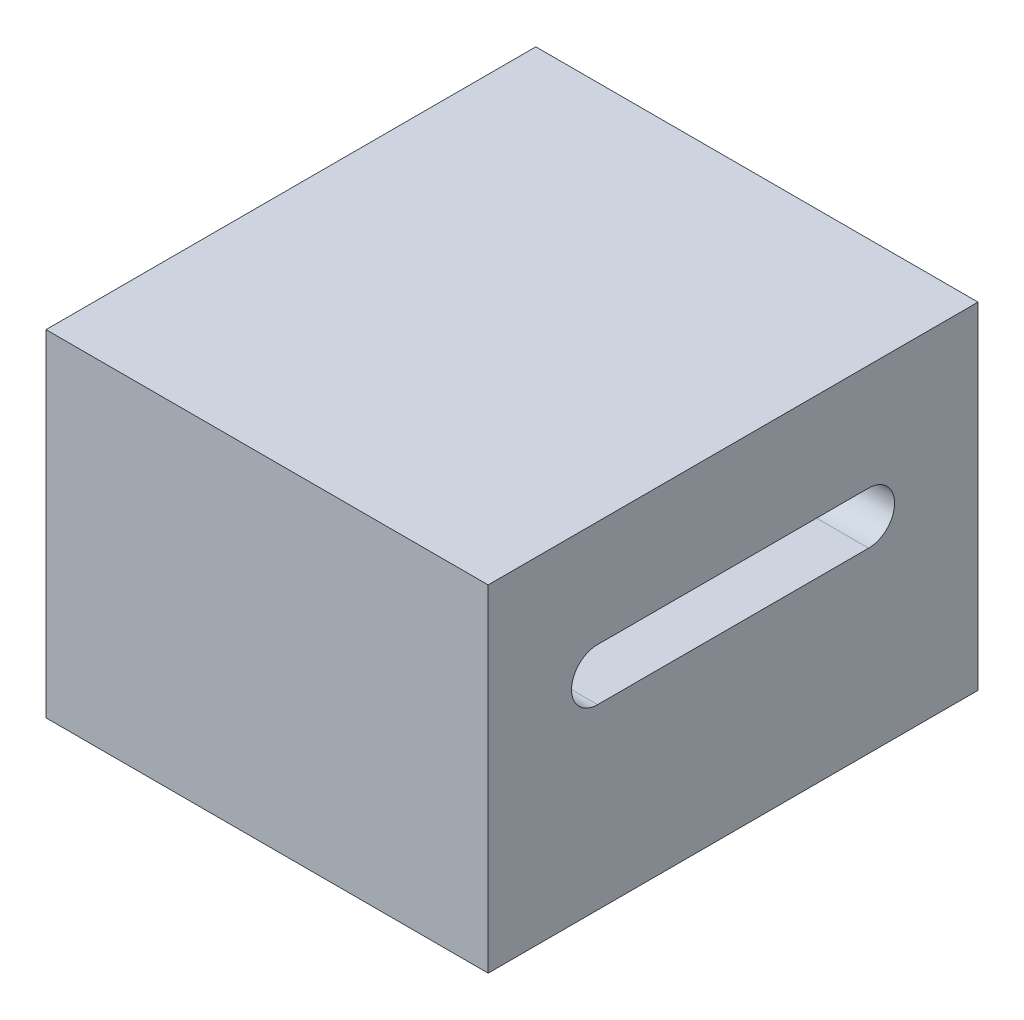
ISO-10303-21;
HEADER;
FILE_DESCRIPTION(('STEP AP214'),'2;1');
FILE_NAME('part.step','',(''),(''),'','','');
FILE_SCHEMA(('AUTOMOTIVE_DESIGN { 1 0 10303 214 1 1 1 1 }'));
ENDSEC;
DATA;
#1=APPLICATION_CONTEXT('core data for automotive mechanical design processes');
#2=APPLICATION_PROTOCOL_DEFINITION('international standard','automotive_design',2000,#1);
#3=PRODUCT_CONTEXT('',#1,'mechanical');
#4=PRODUCT('Part','Part','',(#3));
#5=PRODUCT_RELATED_PRODUCT_CATEGORY('part','',(#4));
#6=PRODUCT_DEFINITION_FORMATION('','',#4);
#7=PRODUCT_DEFINITION_CONTEXT('part definition',#1,'design');
#8=PRODUCT_DEFINITION('design','',#6,#7);
#9=PRODUCT_DEFINITION_SHAPE('','',#8);
#10=(LENGTH_UNIT() NAMED_UNIT(*) SI_UNIT(.MILLI.,.METRE.));
#11=(NAMED_UNIT(*) PLANE_ANGLE_UNIT() SI_UNIT($,.RADIAN.));
#12=(NAMED_UNIT(*) SI_UNIT($,.STERADIAN.) SOLID_ANGLE_UNIT());
#13=UNCERTAINTY_MEASURE_WITH_UNIT(LENGTH_MEASURE(1.E-05),#10,'distance_accuracy_value','');
#14=(GEOMETRIC_REPRESENTATION_CONTEXT(3) GLOBAL_UNCERTAINTY_ASSIGNED_CONTEXT((#13)) GLOBAL_UNIT_ASSIGNED_CONTEXT((#10,
#11,#12)) REPRESENTATION_CONTEXT('',''));
#15=CARTESIAN_POINT('',(0.,0.,0.));
#16=DIRECTION('',(0.,0.,1.));
#17=DIRECTION('',(1.,0.,0.));
#18=AXIS2_PLACEMENT_3D('',#15,#16,#17);
#19=CARTESIAN_POINT('',(0.,32.258,0.));
#20=DIRECTION('',(1.,0.,0.));
#21=DIRECTION('',(0.,0.,-1.));
#22=AXIS2_PLACEMENT_3D('',#19,#20,#21);
#23=PLANE('',#22);
#24=DIRECTION('',(0.,0.,1.));
#25=VECTOR('',#24,1.);
#26=CARTESIAN_POINT('',(0.,22.0541129997099,-10.495));
#27=LINE('',#26,#25);
#28=CARTESIAN_POINT('',(0.,22.0541129997099,-36.495));
#29=VERTEX_POINT('',#28);
#30=CARTESIAN_POINT('',(0.,22.0541129997099,-10.495));
#31=VERTEX_POINT('',#30);
#32=EDGE_CURVE('E112',#29,#31,#27,.T.);
#33=ORIENTED_EDGE('',*,*,#32,.T.);
#34=CARTESIAN_POINT('',(0.,19.558,-10.495));
#35=DIRECTION('',(1.,0.,0.));
#36=DIRECTION('',(0.,0.,-1.));
#37=AXIS2_PLACEMENT_3D('',#34,#35,#36);
#38=CIRCLE('',#37,2.49611299970985);
#39=CARTESIAN_POINT('',(0.,17.0618870002902,-10.495));
#40=VERTEX_POINT('',#39);
#41=EDGE_CURVE('E105',#31,#40,#38,.T.);
#42=ORIENTED_EDGE('',*,*,#41,.T.);
#43=DIRECTION('',(0.,0.,-1.));
#44=VECTOR('',#43,1.);
#45=CARTESIAN_POINT('',(0.,17.0618870002902,-10.495));
#46=LINE('',#45,#44);
#47=CARTESIAN_POINT('',(0.,17.0618870002902,-36.495));
#48=VERTEX_POINT('',#47);
#49=EDGE_CURVE('E115',#40,#48,#46,.T.);
#50=ORIENTED_EDGE('',*,*,#49,.T.);
#51=CARTESIAN_POINT('',(0.,19.558,-36.495));
#52=DIRECTION('',(1.,0.,0.));
#53=DIRECTION('',(0.,0.,-1.));
#54=AXIS2_PLACEMENT_3D('',#51,#52,#53);
#55=CIRCLE('',#54,2.49611299970985);
#56=EDGE_CURVE('E53',#48,#29,#55,.T.);
#57=ORIENTED_EDGE('',*,*,#56,.T.);
#58=EDGE_LOOP('',(#33,#42,#50,#57));
#59=FACE_BOUND('',#58,.T.);
#60=DIRECTION('',(0.,0.,1.));
#61=VECTOR('',#60,1.);
#62=CARTESIAN_POINT('',(0.,0.,0.));
#63=LINE('',#62,#61);
#64=CARTESIAN_POINT('',(0.,0.,-46.99));
#65=VERTEX_POINT('',#64);
#66=CARTESIAN_POINT('',(0.,0.,0.));
#67=VERTEX_POINT('',#66);
#68=EDGE_CURVE('E145',#65,#67,#63,.T.);
#69=ORIENTED_EDGE('',*,*,#68,.T.);
#70=DIRECTION('',(0.,-1.,0.));
#71=VECTOR('',#70,1.);
#72=CARTESIAN_POINT('',(0.,32.258,0.));
#73=LINE('',#72,#71);
#74=CARTESIAN_POINT('',(0.,32.258,0.));
#75=VERTEX_POINT('',#74);
#76=EDGE_CURVE('E11',#75,#67,#73,.T.);
#77=ORIENTED_EDGE('',*,*,#76,.F.);
#78=DIRECTION('',(0.,0.,1.));
#79=VECTOR('',#78,1.);
#80=CARTESIAN_POINT('',(0.,32.258,0.));
#81=LINE('',#80,#79);
#82=CARTESIAN_POINT('',(0.,32.258,-46.99));
#83=VERTEX_POINT('',#82);
#84=EDGE_CURVE('E151',#83,#75,#81,.T.);
#85=ORIENTED_EDGE('',*,*,#84,.F.);
#86=DIRECTION('',(0.,-1.,0.));
#87=VECTOR('',#86,1.);
#88=CARTESIAN_POINT('',(0.,32.258,-46.99));
#89=LINE('',#88,#87);
#90=EDGE_CURVE('E165',#83,#65,#89,.T.);
#91=ORIENTED_EDGE('',*,*,#90,.T.);
#92=EDGE_LOOP('',(#69,#77,#85,#91));
#93=FACE_BOUND('',#92,.T.);
#94=ADVANCED_FACE('F38',(#59,#93),#23,.F.);
#95=CARTESIAN_POINT('',(0.,32.258,0.));
#96=DIRECTION('',(0.,0.,-1.));
#97=DIRECTION('',(-1.,0.,0.));
#98=AXIS2_PLACEMENT_3D('',#95,#96,#97);
#99=PLANE('',#98);
#100=DIRECTION('',(1.,0.,0.));
#101=VECTOR('',#100,1.);
#102=CARTESIAN_POINT('',(0.,0.,0.));
#103=LINE('',#102,#101);
#104=CARTESIAN_POINT('',(42.418,0.,0.));
#105=VERTEX_POINT('',#104);
#106=EDGE_CURVE('E169',#67,#105,#103,.T.);
#107=ORIENTED_EDGE('',*,*,#106,.T.);
#108=DIRECTION('',(0.,-1.,0.));
#109=VECTOR('',#108,1.);
#110=CARTESIAN_POINT('',(42.418,32.258,0.));
#111=LINE('',#110,#109);
#112=CARTESIAN_POINT('',(42.418,32.258,0.));
#113=VERTEX_POINT('',#112);
#114=EDGE_CURVE('E46',#113,#105,#111,.T.);
#115=ORIENTED_EDGE('',*,*,#114,.F.);
#116=DIRECTION('',(1.,0.,0.));
#117=VECTOR('',#116,1.);
#118=CARTESIAN_POINT('',(0.,32.258,0.));
#119=LINE('',#118,#117);
#120=EDGE_CURVE('E155',#75,#113,#119,.T.);
#121=ORIENTED_EDGE('',*,*,#120,.F.);
#122=ORIENTED_EDGE('',*,*,#76,.T.);
#123=EDGE_LOOP('',(#107,#115,#121,#122));
#124=FACE_BOUND('',#123,.T.);
#125=ADVANCED_FACE('F204',(#124),#99,.F.);
#126=CARTESIAN_POINT('',(42.418,32.258,0.));
#127=DIRECTION('',(-1.,0.,0.));
#128=DIRECTION('',(0.,0.,1.));
#129=AXIS2_PLACEMENT_3D('',#126,#127,#128);
#130=PLANE('',#129);
#131=DIRECTION('',(0.,0.,-1.));
#132=VECTOR('',#131,1.);
#133=CARTESIAN_POINT('',(42.418,17.0618870002902,-10.495));
#134=LINE('',#133,#132);
#135=CARTESIAN_POINT('',(42.418,17.0618870002901,-10.495));
#136=VERTEX_POINT('',#135);
#137=CARTESIAN_POINT('',(42.418,17.0618870002902,-36.495));
#138=VERTEX_POINT('',#137);
#139=EDGE_CURVE('E136',#136,#138,#134,.T.);
#140=ORIENTED_EDGE('',*,*,#139,.F.);
#141=CARTESIAN_POINT('',(42.418,19.558,-10.495));
#142=DIRECTION('',(1.,0.,0.));
#143=DIRECTION('',(0.,0.,-1.));
#144=AXIS2_PLACEMENT_3D('',#141,#142,#143);
#145=CIRCLE('',#144,2.49611299970985);
#146=CARTESIAN_POINT('',(42.418,22.0541129997099,-10.495));
#147=VERTEX_POINT('',#146);
#148=EDGE_CURVE('E61',#147,#136,#145,.T.);
#149=ORIENTED_EDGE('',*,*,#148,.F.);
#150=DIRECTION('',(0.,0.,1.));
#151=VECTOR('',#150,1.);
#152=CARTESIAN_POINT('',(42.418,22.0541129997099,-10.495));
#153=LINE('',#152,#151);
#154=CARTESIAN_POINT('',(42.418,22.0541129997099,-36.495));
#155=VERTEX_POINT('',#154);
#156=EDGE_CURVE('E123',#155,#147,#153,.T.);
#157=ORIENTED_EDGE('',*,*,#156,.F.);
#158=CARTESIAN_POINT('',(42.418,19.558,-36.495));
#159=DIRECTION('',(1.,0.,0.));
#160=DIRECTION('',(0.,0.,-1.));
#161=AXIS2_PLACEMENT_3D('',#158,#159,#160);
#162=CIRCLE('',#161,2.49611299970985);
#163=EDGE_CURVE('E127',#138,#155,#162,.T.);
#164=ORIENTED_EDGE('',*,*,#163,.F.);
#165=EDGE_LOOP('',(#140,#149,#157,#164));
#166=FACE_BOUND('',#165,.T.);
#167=DIRECTION('',(0.,0.,-1.));
#168=VECTOR('',#167,1.);
#169=CARTESIAN_POINT('',(42.418,0.,0.));
#170=LINE('',#169,#168);
#171=CARTESIAN_POINT('',(42.418,0.,-46.99));
#172=VERTEX_POINT('',#171);
#173=EDGE_CURVE('E172',#105,#172,#170,.T.);
#174=ORIENTED_EDGE('',*,*,#173,.T.);
#175=DIRECTION('',(0.,-1.,0.));
#176=VECTOR('',#175,1.);
#177=CARTESIAN_POINT('',(42.418,32.258,-46.99));
#178=LINE('',#177,#176);
#179=CARTESIAN_POINT('',(42.418,32.258,-46.99));
#180=VERTEX_POINT('',#179);
#181=EDGE_CURVE('E180',#180,#172,#178,.T.);
#182=ORIENTED_EDGE('',*,*,#181,.F.);
#183=DIRECTION('',(0.,0.,-1.));
#184=VECTOR('',#183,1.);
#185=CARTESIAN_POINT('',(42.418,32.258,0.));
#186=LINE('',#185,#184);
#187=EDGE_CURVE('E159',#113,#180,#186,.T.);
#188=ORIENTED_EDGE('',*,*,#187,.F.);
#189=ORIENTED_EDGE('',*,*,#114,.T.);
#190=EDGE_LOOP('',(#174,#182,#188,#189));
#191=FACE_BOUND('',#190,.T.);
#192=ADVANCED_FACE('F189',(#166,#191),#130,.F.);
#193=CARTESIAN_POINT('',(0.,32.258,-46.99));
#194=DIRECTION('',(0.,0.,1.));
#195=DIRECTION('',(1.,0.,0.));
#196=AXIS2_PLACEMENT_3D('',#193,#194,#195);
#197=PLANE('',#196);
#198=DIRECTION('',(-1.,0.,0.));
#199=VECTOR('',#198,1.);
#200=CARTESIAN_POINT('',(0.,0.,-46.99));
#201=LINE('',#200,#199);
#202=EDGE_CURVE('E156',#172,#65,#201,.T.);
#203=ORIENTED_EDGE('',*,*,#202,.T.);
#204=ORIENTED_EDGE('',*,*,#90,.F.);
#205=DIRECTION('',(-1.,0.,0.));
#206=VECTOR('',#205,1.);
#207=CARTESIAN_POINT('',(0.,32.258,-46.99));
#208=LINE('',#207,#206);
#209=EDGE_CURVE('E162',#180,#83,#208,.T.);
#210=ORIENTED_EDGE('',*,*,#209,.F.);
#211=ORIENTED_EDGE('',*,*,#181,.T.);
#212=EDGE_LOOP('',(#203,#204,#210,#211));
#213=FACE_BOUND('',#212,.T.);
#214=ADVANCED_FACE('F198',(#213),#197,.F.);
#215=CARTESIAN_POINT('',(0.,32.258,0.));
#216=DIRECTION('',(0.,-1.,0.));
#217=DIRECTION('',(0.,0.,-1.));
#218=AXIS2_PLACEMENT_3D('',#215,#216,#217);
#219=PLANE('',#218);
#220=ORIENTED_EDGE('',*,*,#84,.T.);
#221=ORIENTED_EDGE('',*,*,#120,.T.);
#222=ORIENTED_EDGE('',*,*,#187,.T.);
#223=ORIENTED_EDGE('',*,*,#209,.T.);
#224=EDGE_LOOP('',(#220,#221,#222,#223));
#225=FACE_BOUND('',#224,.T.);
#226=ADVANCED_FACE('F203',(#225),#219,.F.);
#227=CARTESIAN_POINT('',(0.,0.,0.));
#228=DIRECTION('',(0.,-1.,0.));
#229=DIRECTION('',(0.,0.,-1.));
#230=AXIS2_PLACEMENT_3D('',#227,#228,#229);
#231=PLANE('',#230);
#232=ORIENTED_EDGE('',*,*,#68,.F.);
#233=ORIENTED_EDGE('',*,*,#202,.F.);
#234=ORIENTED_EDGE('',*,*,#173,.F.);
#235=ORIENTED_EDGE('',*,*,#106,.F.);
#236=EDGE_LOOP('',(#232,#233,#234,#235));
#237=FACE_BOUND('',#236,.T.);
#238=ADVANCED_FACE('F195',(#237),#231,.T.);
#239=CARTESIAN_POINT('',(0.,19.558,-10.495));
#240=DIRECTION('',(1.,0.,0.));
#241=DIRECTION('',(0.,0.,-1.));
#242=AXIS2_PLACEMENT_3D('',#239,#240,#241);
#243=CYLINDRICAL_SURFACE('',#242,2.49611299970985);
#244=ORIENTED_EDGE('',*,*,#148,.T.);
#245=DIRECTION('',(1.,0.,0.));
#246=VECTOR('',#245,1.);
#247=CARTESIAN_POINT('',(0.,17.0618870002902,-10.495));
#248=LINE('',#247,#246);
#249=EDGE_CURVE('E101',#40,#136,#248,.T.);
#250=ORIENTED_EDGE('',*,*,#249,.F.);
#251=ORIENTED_EDGE('',*,*,#41,.F.);
#252=DIRECTION('',(1.,0.,0.));
#253=VECTOR('',#252,1.);
#254=CARTESIAN_POINT('',(0.,22.0541129997099,-10.495));
#255=LINE('',#254,#253);
#256=EDGE_CURVE('E142',#31,#147,#255,.T.);
#257=ORIENTED_EDGE('',*,*,#256,.T.);
#258=EDGE_LOOP('',(#244,#250,#251,#257));
#259=FACE_BOUND('',#258,.T.);
#260=ADVANCED_FACE('F103',(#259),#243,.F.);
#261=CARTESIAN_POINT('',(0.,22.0541129997099,-10.495));
#262=DIRECTION('',(0.,1.,0.));
#263=DIRECTION('',(0.,0.,1.));
#264=AXIS2_PLACEMENT_3D('',#261,#262,#263);
#265=PLANE('',#264);
#266=ORIENTED_EDGE('',*,*,#156,.T.);
#267=ORIENTED_EDGE('',*,*,#256,.F.);
#268=ORIENTED_EDGE('',*,*,#32,.F.);
#269=DIRECTION('',(1.,0.,0.));
#270=VECTOR('',#269,1.);
#271=CARTESIAN_POINT('',(0.,22.0541129997099,-36.495));
#272=LINE('',#271,#270);
#273=EDGE_CURVE('E146',#29,#155,#272,.T.);
#274=ORIENTED_EDGE('',*,*,#273,.T.);
#275=EDGE_LOOP('',(#266,#267,#268,#274));
#276=FACE_BOUND('',#275,.T.);
#277=ADVANCED_FACE('F223',(#276),#265,.F.);
#278=CARTESIAN_POINT('',(0.,19.558,-36.495));
#279=DIRECTION('',(1.,0.,0.));
#280=DIRECTION('',(0.,0.,-1.));
#281=AXIS2_PLACEMENT_3D('',#278,#279,#280);
#282=CYLINDRICAL_SURFACE('',#281,2.49611299970985);
#283=ORIENTED_EDGE('',*,*,#163,.T.);
#284=ORIENTED_EDGE('',*,*,#273,.F.);
#285=ORIENTED_EDGE('',*,*,#56,.F.);
#286=DIRECTION('',(1.,0.,0.));
#287=VECTOR('',#286,1.);
#288=CARTESIAN_POINT('',(0.,17.0618870002902,-36.495));
#289=LINE('',#288,#287);
#290=EDGE_CURVE('E111',#48,#138,#289,.T.);
#291=ORIENTED_EDGE('',*,*,#290,.T.);
#292=EDGE_LOOP('',(#283,#284,#285,#291));
#293=FACE_BOUND('',#292,.T.);
#294=ADVANCED_FACE('F226',(#293),#282,.F.);
#295=CARTESIAN_POINT('',(0.,17.0618870002902,-10.495));
#296=DIRECTION('',(0.,-1.,0.));
#297=DIRECTION('',(0.,0.,-1.));
#298=AXIS2_PLACEMENT_3D('',#295,#296,#297);
#299=PLANE('',#298);
#300=ORIENTED_EDGE('',*,*,#139,.T.);
#301=ORIENTED_EDGE('',*,*,#290,.F.);
#302=ORIENTED_EDGE('',*,*,#49,.F.);
#303=ORIENTED_EDGE('',*,*,#249,.T.);
#304=EDGE_LOOP('',(#300,#301,#302,#303));
#305=FACE_BOUND('',#304,.T.);
#306=ADVANCED_FACE('F116',(#305),#299,.F.);
#307=CLOSED_SHELL('',(#94,#125,#192,#214,#226,#238,#260,#277,#294,#306));
#308=MANIFOLD_SOLID_BREP('B2',#307);
#309=ADVANCED_BREP_SHAPE_REPRESENTATION('',(#18,#308),#14);
#310=SHAPE_DEFINITION_REPRESENTATION(#9,#309);
ENDSEC;
END-ISO-10303-21;
